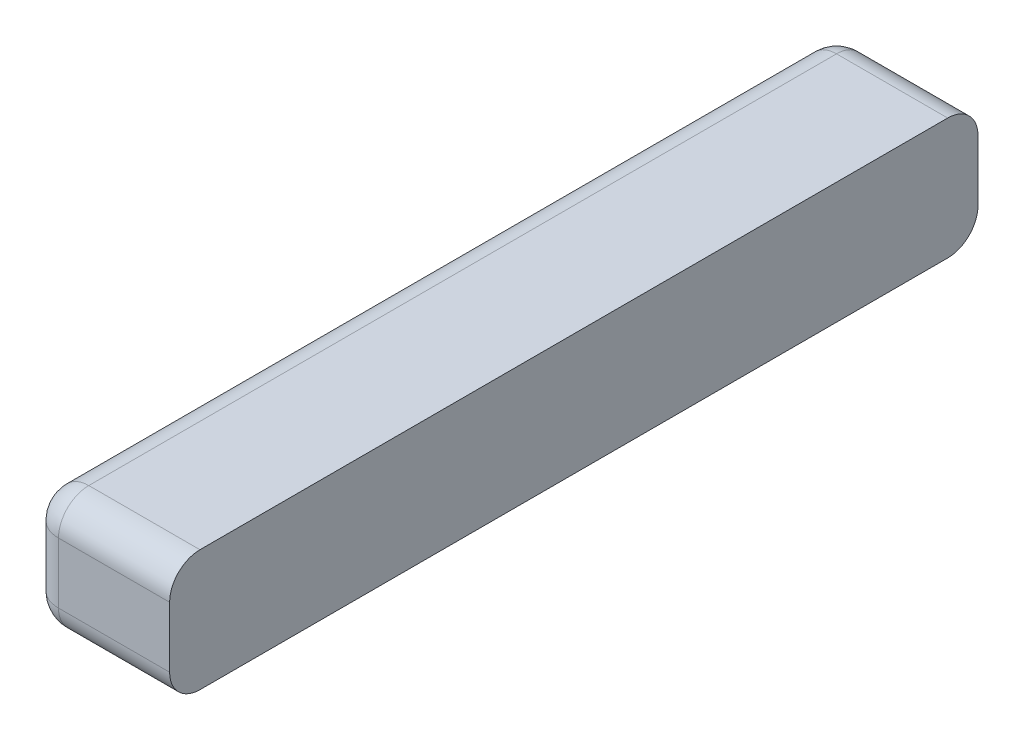
ISO-10303-21;
HEADER;
FILE_DESCRIPTION(('STEP AP214'),'2;1');
FILE_NAME('part.step','',(''),(''),'','','');
FILE_SCHEMA(('AUTOMOTIVE_DESIGN { 1 0 10303 214 1 1 1 1 }'));
ENDSEC;
DATA;
#1=APPLICATION_CONTEXT('core data for automotive mechanical design processes');
#2=APPLICATION_PROTOCOL_DEFINITION('international standard','automotive_design',2000,#1);
#3=PRODUCT_CONTEXT('',#1,'mechanical');
#4=PRODUCT('Part','Part','',(#3));
#5=PRODUCT_RELATED_PRODUCT_CATEGORY('part','',(#4));
#6=PRODUCT_DEFINITION_FORMATION('','',#4);
#7=PRODUCT_DEFINITION_CONTEXT('part definition',#1,'design');
#8=PRODUCT_DEFINITION('design','',#6,#7);
#9=PRODUCT_DEFINITION_SHAPE('','',#8);
#10=(LENGTH_UNIT() NAMED_UNIT(*) SI_UNIT(.MILLI.,.METRE.));
#11=(NAMED_UNIT(*) PLANE_ANGLE_UNIT() SI_UNIT($,.RADIAN.));
#12=(NAMED_UNIT(*) SI_UNIT($,.STERADIAN.) SOLID_ANGLE_UNIT());
#13=UNCERTAINTY_MEASURE_WITH_UNIT(LENGTH_MEASURE(1.E-05),#10,'distance_accuracy_value','');
#14=(GEOMETRIC_REPRESENTATION_CONTEXT(3) GLOBAL_UNCERTAINTY_ASSIGNED_CONTEXT((#13)) GLOBAL_UNIT_ASSIGNED_CONTEXT((#10,
#11,#12)) REPRESENTATION_CONTEXT('',''));
#15=CARTESIAN_POINT('',(0.,0.,0.));
#16=DIRECTION('',(0.,0.,1.));
#17=DIRECTION('',(1.,0.,0.));
#18=AXIS2_PLACEMENT_3D('',#15,#16,#17);
#19=CARTESIAN_POINT('',(-25.10519280825,0.,29.371744981599));
#20=DIRECTION('',(0.,-1.,0.));
#21=DIRECTION('',(0.,0.,-1.));
#22=AXIS2_PLACEMENT_3D('',#19,#20,#21);
#23=CYLINDRICAL_SURFACE('',#22,1.5);
#24=CARTESIAN_POINT('',(-25.10519280825,1.5,29.371744981599));
#25=DIRECTION('',(0.,1.,0.));
#26=DIRECTION('',(1.,0.,0.));
#27=AXIS2_PLACEMENT_3D('',#24,#25,#26);
#28=CIRCLE('',#27,1.5);
#29=CARTESIAN_POINT('',(-26.60519280825,1.5,29.371744981599));
#30=VERTEX_POINT('',#29);
#31=CARTESIAN_POINT('',(-25.10519280825,1.5,30.871744981599));
#32=VERTEX_POINT('',#31);
#33=EDGE_CURVE('E26',#30,#32,#28,.T.);
#34=ORIENTED_EDGE('',*,*,#33,.T.);
#35=DIRECTION('',(0.,-1.,0.));
#36=VECTOR('',#35,1.);
#37=CARTESIAN_POINT('',(-25.10519280825,0.,30.871744981599));
#38=LINE('',#37,#36);
#39=CARTESIAN_POINT('',(-25.10519280825,4.5,30.871744981599));
#40=VERTEX_POINT('',#39);
#41=EDGE_CURVE('E153',#40,#32,#38,.T.);
#42=ORIENTED_EDGE('',*,*,#41,.F.);
#43=CARTESIAN_POINT('',(-25.10519280825,4.5,29.371744981599));
#44=DIRECTION('',(0.,-1.,0.));
#45=DIRECTION('',(0.,0.,1.));
#46=AXIS2_PLACEMENT_3D('',#43,#44,#45);
#47=CIRCLE('',#46,1.5);
#48=CARTESIAN_POINT('',(-26.60519280825,4.5,29.371744981599));
#49=VERTEX_POINT('',#48);
#50=EDGE_CURVE('E11',#40,#49,#47,.T.);
#51=ORIENTED_EDGE('',*,*,#50,.T.);
#52=DIRECTION('',(0.,1.,0.));
#53=VECTOR('',#52,1.);
#54=CARTESIAN_POINT('',(-26.60519280825,6.,29.371744981599));
#55=LINE('',#54,#53);
#56=EDGE_CURVE('E148',#30,#49,#55,.T.);
#57=ORIENTED_EDGE('',*,*,#56,.F.);
#58=EDGE_LOOP('',(#34,#42,#51,#57));
#59=FACE_BOUND('',#58,.T.);
#60=ADVANCED_FACE('F16',(#59),#23,.T.);
#61=CARTESIAN_POINT('',(-25.10519280825,4.5,29.371744981599));
#62=DIRECTION('',(0.,1.,0.));
#63=DIRECTION('',(0.,0.,1.));
#64=AXIS2_PLACEMENT_3D('',#61,#62,#63);
#65=SPHERICAL_SURFACE('',#64,1.5);
#66=CARTESIAN_POINT('',(-25.10519280825,4.5,29.371744981599));
#67=DIRECTION('',(-1.,0.,0.));
#68=DIRECTION('',(0.,0.,1.));
#69=AXIS2_PLACEMENT_3D('',#66,#67,#68);
#70=CIRCLE('',#69,1.5);
#71=CARTESIAN_POINT('',(-25.10519280825,6.,29.371744981599));
#72=VERTEX_POINT('',#71);
#73=EDGE_CURVE('E177',#40,#72,#70,.T.);
#74=ORIENTED_EDGE('',*,*,#73,.T.);
#75=CARTESIAN_POINT('',(-25.10519280825,4.5,29.371744981599));
#76=DIRECTION('',(0.,0.,1.));
#77=DIRECTION('',(1.,0.,0.));
#78=AXIS2_PLACEMENT_3D('',#75,#76,#77);
#79=CIRCLE('',#78,1.5);
#80=EDGE_CURVE('E174',#72,#49,#79,.T.);
#81=ORIENTED_EDGE('',*,*,#80,.T.);
#82=ORIENTED_EDGE('',*,*,#50,.F.);
#83=EDGE_LOOP('',(#74,#81,#82));
#84=FACE_BOUND('',#83,.T.);
#85=ADVANCED_FACE('F314',(#84),#65,.T.);
#86=CARTESIAN_POINT('',(-25.10519280825,1.5,29.371744981599));
#87=DIRECTION('',(0.,-1.,0.));
#88=DIRECTION('',(0.,0.,-1.));
#89=AXIS2_PLACEMENT_3D('',#86,#87,#88);
#90=SPHERICAL_SURFACE('',#89,1.5);
#91=CARTESIAN_POINT('',(-25.10519280825,1.5,29.371744981599));
#92=DIRECTION('',(0.,0.,1.));
#93=DIRECTION('',(1.,0.,0.));
#94=AXIS2_PLACEMENT_3D('',#91,#92,#93);
#95=CIRCLE('',#94,1.5);
#96=CARTESIAN_POINT('',(-25.10519280825,0.,29.371744981599));
#97=VERTEX_POINT('',#96);
#98=EDGE_CURVE('E170',#30,#97,#95,.T.);
#99=ORIENTED_EDGE('',*,*,#98,.T.);
#100=CARTESIAN_POINT('',(-25.10519280825,1.5,29.371744981599));
#101=DIRECTION('',(-1.,0.,0.));
#102=DIRECTION('',(0.,0.,1.));
#103=AXIS2_PLACEMENT_3D('',#100,#101,#102);
#104=CIRCLE('',#103,1.5);
#105=EDGE_CURVE('E19',#97,#32,#104,.T.);
#106=ORIENTED_EDGE('',*,*,#105,.T.);
#107=ORIENTED_EDGE('',*,*,#33,.F.);
#108=EDGE_LOOP('',(#99,#106,#107));
#109=FACE_BOUND('',#108,.T.);
#110=ADVANCED_FACE('F232',(#109),#90,.T.);
#111=CARTESIAN_POINT('',(-26.60519280825,4.5,29.371744981599));
#112=DIRECTION('',(1.,0.,0.));
#113=DIRECTION('',(0.,0.,-1.));
#114=AXIS2_PLACEMENT_3D('',#111,#112,#113);
#115=CYLINDRICAL_SURFACE('',#114,1.5);
#116=CARTESIAN_POINT('',(-19.60519280825,4.5,29.371744981599));
#117=DIRECTION('',(1.,0.,0.));
#118=DIRECTION('',(0.,0.,1.));
#119=AXIS2_PLACEMENT_3D('',#116,#117,#118);
#120=CIRCLE('',#119,1.5);
#121=CARTESIAN_POINT('',(-19.60519280825,6.,29.371744981599));
#122=VERTEX_POINT('',#121);
#123=CARTESIAN_POINT('',(-19.60519280825,4.5,30.871744981599));
#124=VERTEX_POINT('',#123);
#125=EDGE_CURVE('E187',#122,#124,#120,.T.);
#126=ORIENTED_EDGE('',*,*,#125,.F.);
#127=DIRECTION('',(1.,0.,0.));
#128=VECTOR('',#127,1.);
#129=CARTESIAN_POINT('',(-26.60519280825,6.,29.371744981599));
#130=LINE('',#129,#128);
#131=EDGE_CURVE('E159',#72,#122,#130,.T.);
#132=ORIENTED_EDGE('',*,*,#131,.F.);
#133=ORIENTED_EDGE('',*,*,#73,.F.);
#134=DIRECTION('',(-1.,0.,0.));
#135=VECTOR('',#134,1.);
#136=CARTESIAN_POINT('',(-26.60519280825,4.5,30.871744981599));
#137=LINE('',#136,#135);
#138=EDGE_CURVE('E150',#124,#40,#137,.T.);
#139=ORIENTED_EDGE('',*,*,#138,.F.);
#140=EDGE_LOOP('',(#126,#132,#133,#139));
#141=FACE_BOUND('',#140,.T.);
#142=ADVANCED_FACE('F225',(#141),#115,.T.);
#143=CARTESIAN_POINT('',(-25.10519280825,4.5,0.));
#144=DIRECTION('',(0.,0.,1.));
#145=DIRECTION('',(1.,0.,0.));
#146=AXIS2_PLACEMENT_3D('',#143,#144,#145);
#147=CYLINDRICAL_SURFACE('',#146,1.5);
#148=CARTESIAN_POINT('',(-25.10519280825,4.5,-7.628255018401));
#149=DIRECTION('',(0.,0.,1.));
#150=DIRECTION('',(-1.,0.,0.));
#151=AXIS2_PLACEMENT_3D('',#148,#149,#150);
#152=CIRCLE('',#151,1.5);
#153=CARTESIAN_POINT('',(-25.10519280825,6.,-7.628255018401));
#154=VERTEX_POINT('',#153);
#155=CARTESIAN_POINT('',(-26.60519280825,4.5,-7.628255018401));
#156=VERTEX_POINT('',#155);
#157=EDGE_CURVE('E40',#154,#156,#152,.T.);
#158=ORIENTED_EDGE('',*,*,#157,.T.);
#159=DIRECTION('',(0.,0.,-1.));
#160=VECTOR('',#159,1.);
#161=CARTESIAN_POINT('',(-26.60519280825,4.5,-9.128255018401));
#162=LINE('',#161,#160);
#163=EDGE_CURVE('E188',#49,#156,#162,.T.);
#164=ORIENTED_EDGE('',*,*,#163,.F.);
#165=ORIENTED_EDGE('',*,*,#80,.F.);
#166=DIRECTION('',(0.,0.,1.));
#167=VECTOR('',#166,1.);
#168=CARTESIAN_POINT('',(-25.10519280825,6.,30.871744981599));
#169=LINE('',#168,#167);
#170=EDGE_CURVE('E164',#154,#72,#169,.T.);
#171=ORIENTED_EDGE('',*,*,#170,.F.);
#172=EDGE_LOOP('',(#158,#164,#165,#171));
#173=FACE_BOUND('',#172,.T.);
#174=ADVANCED_FACE('F231',(#173),#147,.T.);
#175=CARTESIAN_POINT('',(-25.10519280825,1.5,0.));
#176=DIRECTION('',(0.,0.,-1.));
#177=DIRECTION('',(-1.,0.,0.));
#178=AXIS2_PLACEMENT_3D('',#175,#176,#177);
#179=CYLINDRICAL_SURFACE('',#178,1.5);
#180=CARTESIAN_POINT('',(-25.10519280825,1.5,-7.628255018401));
#181=DIRECTION('',(0.,0.,1.));
#182=DIRECTION('',(-1.,0.,0.));
#183=AXIS2_PLACEMENT_3D('',#180,#181,#182);
#184=CIRCLE('',#183,1.5);
#185=CARTESIAN_POINT('',(-26.60519280825,1.5,-7.628255018401));
#186=VERTEX_POINT('',#185);
#187=CARTESIAN_POINT('',(-25.10519280825,0.,-7.628255018401));
#188=VERTEX_POINT('',#187);
#189=EDGE_CURVE('E168',#186,#188,#184,.T.);
#190=ORIENTED_EDGE('',*,*,#189,.T.);
#191=DIRECTION('',(0.,0.,-1.));
#192=VECTOR('',#191,1.);
#193=CARTESIAN_POINT('',(-25.10519280825,0.,-9.128255018401));
#194=LINE('',#193,#192);
#195=EDGE_CURVE('E183',#97,#188,#194,.T.);
#196=ORIENTED_EDGE('',*,*,#195,.F.);
#197=ORIENTED_EDGE('',*,*,#98,.F.);
#198=DIRECTION('',(0.,0.,1.));
#199=VECTOR('',#198,1.);
#200=CARTESIAN_POINT('',(-26.60519280825,1.5,30.871744981599));
#201=LINE('',#200,#199);
#202=EDGE_CURVE('E207',#186,#30,#201,.T.);
#203=ORIENTED_EDGE('',*,*,#202,.F.);
#204=EDGE_LOOP('',(#190,#196,#197,#203));
#205=FACE_BOUND('',#204,.T.);
#206=ADVANCED_FACE('F257',(#205),#179,.T.);
#207=CARTESIAN_POINT('',(-26.60519280825,1.5,29.371744981599));
#208=DIRECTION('',(1.,0.,0.));
#209=DIRECTION('',(0.,0.,-1.));
#210=AXIS2_PLACEMENT_3D('',#207,#208,#209);
#211=CYLINDRICAL_SURFACE('',#210,1.5);
#212=CARTESIAN_POINT('',(-19.60519280825,1.5,29.371744981599));
#213=DIRECTION('',(1.,0.,0.));
#214=DIRECTION('',(0.,0.,1.));
#215=AXIS2_PLACEMENT_3D('',#212,#213,#214);
#216=CIRCLE('',#215,1.5);
#217=CARTESIAN_POINT('',(-19.60519280825,1.5,30.871744981599));
#218=VERTEX_POINT('',#217);
#219=CARTESIAN_POINT('',(-19.60519280825,0.,29.371744981599));
#220=VERTEX_POINT('',#219);
#221=EDGE_CURVE('E184',#218,#220,#216,.T.);
#222=ORIENTED_EDGE('',*,*,#221,.F.);
#223=DIRECTION('',(1.,0.,0.));
#224=VECTOR('',#223,1.);
#225=CARTESIAN_POINT('',(-26.60519280825,1.5,30.871744981599));
#226=LINE('',#225,#224);
#227=EDGE_CURVE('E158',#32,#218,#226,.T.);
#228=ORIENTED_EDGE('',*,*,#227,.F.);
#229=ORIENTED_EDGE('',*,*,#105,.F.);
#230=DIRECTION('',(-1.,0.,0.));
#231=VECTOR('',#230,1.);
#232=CARTESIAN_POINT('',(-26.60519280825,0.,29.371744981599));
#233=LINE('',#232,#231);
#234=EDGE_CURVE('E179',#220,#97,#233,.T.);
#235=ORIENTED_EDGE('',*,*,#234,.F.);
#236=EDGE_LOOP('',(#222,#228,#229,#235));
#237=FACE_BOUND('',#236,.T.);
#238=ADVANCED_FACE('F252',(#237),#211,.T.);
#239=CARTESIAN_POINT('',(-25.10519280825,4.5,-7.628255018401));
#240=DIRECTION('',(0.,0.,-1.));
#241=DIRECTION('',(-1.,0.,0.));
#242=AXIS2_PLACEMENT_3D('',#239,#240,#241);
#243=SPHERICAL_SURFACE('',#242,1.5);
#244=CARTESIAN_POINT('',(-25.10519280825,4.5,-7.628255018401));
#245=DIRECTION('',(-1.,0.,0.));
#246=DIRECTION('',(0.,0.,1.));
#247=AXIS2_PLACEMENT_3D('',#244,#245,#246);
#248=CIRCLE('',#247,1.5);
#249=CARTESIAN_POINT('',(-25.10519280825,4.5,-9.128255018401));
#250=VERTEX_POINT('',#249);
#251=EDGE_CURVE('E165',#154,#250,#248,.T.);
#252=ORIENTED_EDGE('',*,*,#251,.T.);
#253=CARTESIAN_POINT('',(-25.10519280825,4.5,-7.628255018401));
#254=DIRECTION('',(0.,1.,0.));
#255=DIRECTION('',(0.,0.,1.));
#256=AXIS2_PLACEMENT_3D('',#253,#254,#255);
#257=CIRCLE('',#256,1.5);
#258=EDGE_CURVE('E199',#250,#156,#257,.T.);
#259=ORIENTED_EDGE('',*,*,#258,.T.);
#260=ORIENTED_EDGE('',*,*,#157,.F.);
#261=EDGE_LOOP('',(#252,#259,#260));
#262=FACE_BOUND('',#261,.T.);
#263=ADVANCED_FACE('F256',(#262),#243,.T.);
#264=CARTESIAN_POINT('',(-25.10519280825,1.5,-7.628255018401));
#265=DIRECTION('',(0.,0.,-1.));
#266=DIRECTION('',(-1.,0.,0.));
#267=AXIS2_PLACEMENT_3D('',#264,#265,#266);
#268=SPHERICAL_SURFACE('',#267,1.5);
#269=CARTESIAN_POINT('',(-25.10519280825,1.5,-7.628255018401));
#270=DIRECTION('',(0.,-1.,0.));
#271=DIRECTION('',(0.,0.,-1.));
#272=AXIS2_PLACEMENT_3D('',#269,#270,#271);
#273=CIRCLE('',#272,1.5);
#274=CARTESIAN_POINT('',(-25.10519280825,1.5,-9.128255018401));
#275=VERTEX_POINT('',#274);
#276=EDGE_CURVE('E169',#186,#275,#273,.T.);
#277=ORIENTED_EDGE('',*,*,#276,.T.);
#278=CARTESIAN_POINT('',(-25.10519280825,1.5,-7.628255018401));
#279=DIRECTION('',(-1.,0.,0.));
#280=DIRECTION('',(0.,0.,1.));
#281=AXIS2_PLACEMENT_3D('',#278,#279,#280);
#282=CIRCLE('',#281,1.5);
#283=EDGE_CURVE('E121',#275,#188,#282,.T.);
#284=ORIENTED_EDGE('',*,*,#283,.T.);
#285=ORIENTED_EDGE('',*,*,#189,.F.);
#286=EDGE_LOOP('',(#277,#284,#285));
#287=FACE_BOUND('',#286,.T.);
#288=ADVANCED_FACE('F265',(#287),#268,.T.);
#289=CARTESIAN_POINT('',(-26.60519280825,4.5,-7.628255018401));
#290=DIRECTION('',(1.,0.,0.));
#291=DIRECTION('',(0.,0.,-1.));
#292=AXIS2_PLACEMENT_3D('',#289,#290,#291);
#293=CYLINDRICAL_SURFACE('',#292,1.5);
#294=CARTESIAN_POINT('',(-19.60519280825,4.5,-7.628255018401));
#295=DIRECTION('',(1.,0.,0.));
#296=DIRECTION('',(0.,0.,1.));
#297=AXIS2_PLACEMENT_3D('',#294,#295,#296);
#298=CIRCLE('',#297,1.5);
#299=CARTESIAN_POINT('',(-19.60519280825,4.5,-9.128255018401));
#300=VERTEX_POINT('',#299);
#301=CARTESIAN_POINT('',(-19.60519280825,6.,-7.628255018401));
#302=VERTEX_POINT('',#301);
#303=EDGE_CURVE('E108',#300,#302,#298,.T.);
#304=ORIENTED_EDGE('',*,*,#303,.F.);
#305=DIRECTION('',(1.,0.,0.));
#306=VECTOR('',#305,1.);
#307=CARTESIAN_POINT('',(-26.60519280825,4.5,-9.128255018401));
#308=LINE('',#307,#306);
#309=EDGE_CURVE('E112',#250,#300,#308,.T.);
#310=ORIENTED_EDGE('',*,*,#309,.F.);
#311=ORIENTED_EDGE('',*,*,#251,.F.);
#312=DIRECTION('',(-1.,0.,0.));
#313=VECTOR('',#312,1.);
#314=CARTESIAN_POINT('',(-26.60519280825,6.,-7.628255018401));
#315=LINE('',#314,#313);
#316=EDGE_CURVE('E115',#302,#154,#315,.T.);
#317=ORIENTED_EDGE('',*,*,#316,.F.);
#318=EDGE_LOOP('',(#304,#310,#311,#317));
#319=FACE_BOUND('',#318,.T.);
#320=ADVANCED_FACE('F110',(#319),#293,.T.);
#321=CARTESIAN_POINT('',(-25.10519280825,0.,-7.628255018401));
#322=DIRECTION('',(0.,1.,0.));
#323=DIRECTION('',(0.,0.,1.));
#324=AXIS2_PLACEMENT_3D('',#321,#322,#323);
#325=CYLINDRICAL_SURFACE('',#324,1.5);
#326=ORIENTED_EDGE('',*,*,#258,.F.);
#327=DIRECTION('',(0.,1.,0.));
#328=VECTOR('',#327,1.);
#329=CARTESIAN_POINT('',(-25.10519280825,6.,-9.128255018401));
#330=LINE('',#329,#328);
#331=EDGE_CURVE('E130',#275,#250,#330,.T.);
#332=ORIENTED_EDGE('',*,*,#331,.F.);
#333=ORIENTED_EDGE('',*,*,#276,.F.);
#334=DIRECTION('',(0.,-1.,0.));
#335=VECTOR('',#334,1.);
#336=CARTESIAN_POINT('',(-26.60519280825,0.,-7.628255018401));
#337=LINE('',#336,#335);
#338=EDGE_CURVE('E192',#156,#186,#337,.T.);
#339=ORIENTED_EDGE('',*,*,#338,.F.);
#340=EDGE_LOOP('',(#326,#332,#333,#339));
#341=FACE_BOUND('',#340,.T.);
#342=ADVANCED_FACE('F292',(#341),#325,.T.);
#343=CARTESIAN_POINT('',(-26.60519280825,1.5,-7.628255018401));
#344=DIRECTION('',(1.,0.,0.));
#345=DIRECTION('',(0.,0.,-1.));
#346=AXIS2_PLACEMENT_3D('',#343,#344,#345);
#347=CYLINDRICAL_SURFACE('',#346,1.5);
#348=CARTESIAN_POINT('',(-19.60519280825,1.5,-7.628255018401));
#349=DIRECTION('',(1.,0.,0.));
#350=DIRECTION('',(0.,0.,1.));
#351=AXIS2_PLACEMENT_3D('',#348,#349,#350);
#352=CIRCLE('',#351,1.5);
#353=CARTESIAN_POINT('',(-19.60519280825,0.,-7.628255018401));
#354=VERTEX_POINT('',#353);
#355=CARTESIAN_POINT('',(-19.60519280825,1.5,-9.128255018401));
#356=VERTEX_POINT('',#355);
#357=EDGE_CURVE('E122',#354,#356,#352,.T.);
#358=ORIENTED_EDGE('',*,*,#357,.F.);
#359=DIRECTION('',(1.,0.,0.));
#360=VECTOR('',#359,1.);
#361=CARTESIAN_POINT('',(-26.60519280825,0.,-7.628255018401));
#362=LINE('',#361,#360);
#363=EDGE_CURVE('E196',#188,#354,#362,.T.);
#364=ORIENTED_EDGE('',*,*,#363,.F.);
#365=ORIENTED_EDGE('',*,*,#283,.F.);
#366=DIRECTION('',(-1.,0.,0.));
#367=VECTOR('',#366,1.);
#368=CARTESIAN_POINT('',(-26.60519280825,1.5,-9.128255018401));
#369=LINE('',#368,#367);
#370=EDGE_CURVE('E139',#356,#275,#369,.T.);
#371=ORIENTED_EDGE('',*,*,#370,.F.);
#372=EDGE_LOOP('',(#358,#364,#365,#371));
#373=FACE_BOUND('',#372,.T.);
#374=ADVANCED_FACE('F288',(#373),#347,.T.);
#375=CARTESIAN_POINT('',(-19.60519280825,0.,0.));
#376=DIRECTION('',(-1.,0.,0.));
#377=DIRECTION('',(0.,0.,1.));
#378=AXIS2_PLACEMENT_3D('',#375,#376,#377);
#379=PLANE('',#378);
#380=DIRECTION('',(0.,0.,-1.));
#381=VECTOR('',#380,1.);
#382=CARTESIAN_POINT('',(-19.60519280825,6.,-9.128255018401));
#383=LINE('',#382,#381);
#384=EDGE_CURVE('E163',#122,#302,#383,.T.);
#385=ORIENTED_EDGE('',*,*,#384,.F.);
#386=ORIENTED_EDGE('',*,*,#125,.T.);
#387=DIRECTION('',(0.,1.,0.));
#388=VECTOR('',#387,1.);
#389=CARTESIAN_POINT('',(-19.60519280825,6.,30.871744981599));
#390=LINE('',#389,#388);
#391=EDGE_CURVE('E154',#218,#124,#390,.T.);
#392=ORIENTED_EDGE('',*,*,#391,.F.);
#393=ORIENTED_EDGE('',*,*,#221,.T.);
#394=DIRECTION('',(0.,0.,1.));
#395=VECTOR('',#394,1.);
#396=CARTESIAN_POINT('',(-19.60519280825,0.,-9.128255018401));
#397=LINE('',#396,#395);
#398=EDGE_CURVE('E132',#354,#220,#397,.T.);
#399=ORIENTED_EDGE('',*,*,#398,.F.);
#400=ORIENTED_EDGE('',*,*,#357,.T.);
#401=DIRECTION('',(0.,-1.,0.));
#402=VECTOR('',#401,1.);
#403=CARTESIAN_POINT('',(-19.60519280825,6.,-9.128255018401));
#404=LINE('',#403,#402);
#405=EDGE_CURVE('E128',#300,#356,#404,.T.);
#406=ORIENTED_EDGE('',*,*,#405,.F.);
#407=ORIENTED_EDGE('',*,*,#303,.T.);
#408=EDGE_LOOP('',(#385,#386,#392,#393,#399,#400,#406,#407));
#409=FACE_BOUND('',#408,.T.);
#410=ADVANCED_FACE('F134',(#409),#379,.F.);
#411=CARTESIAN_POINT('',(-26.60519280825,0.,0.));
#412=DIRECTION('',(-1.,0.,0.));
#413=DIRECTION('',(0.,0.,1.));
#414=AXIS2_PLACEMENT_3D('',#411,#412,#413);
#415=PLANE('',#414);
#416=ORIENTED_EDGE('',*,*,#202,.T.);
#417=ORIENTED_EDGE('',*,*,#56,.T.);
#418=ORIENTED_EDGE('',*,*,#163,.T.);
#419=ORIENTED_EDGE('',*,*,#338,.T.);
#420=EDGE_LOOP('',(#416,#417,#418,#419));
#421=FACE_BOUND('',#420,.T.);
#422=ADVANCED_FACE('F300',(#421),#415,.T.);
#423=CARTESIAN_POINT('',(-26.60519280825,6.,-9.128255018401));
#424=DIRECTION('',(0.,-1.,0.));
#425=DIRECTION('',(0.,0.,-1.));
#426=AXIS2_PLACEMENT_3D('',#423,#424,#425);
#427=PLANE('',#426);
#428=ORIENTED_EDGE('',*,*,#170,.T.);
#429=ORIENTED_EDGE('',*,*,#131,.T.);
#430=ORIENTED_EDGE('',*,*,#384,.T.);
#431=ORIENTED_EDGE('',*,*,#316,.T.);
#432=EDGE_LOOP('',(#428,#429,#430,#431));
#433=FACE_BOUND('',#432,.T.);
#434=ADVANCED_FACE('F280',(#433),#427,.F.);
#435=CARTESIAN_POINT('',(-26.60519280825,6.,30.871744981599));
#436=DIRECTION('',(0.,0.,-1.));
#437=DIRECTION('',(0.,-1.,0.));
#438=AXIS2_PLACEMENT_3D('',#435,#436,#437);
#439=PLANE('',#438);
#440=ORIENTED_EDGE('',*,*,#391,.T.);
#441=ORIENTED_EDGE('',*,*,#138,.T.);
#442=ORIENTED_EDGE('',*,*,#41,.T.);
#443=ORIENTED_EDGE('',*,*,#227,.T.);
#444=EDGE_LOOP('',(#440,#441,#442,#443));
#445=FACE_BOUND('',#444,.T.);
#446=ADVANCED_FACE('F276',(#445),#439,.F.);
#447=CARTESIAN_POINT('',(-26.60519280825,0.,-9.128255018401));
#448=DIRECTION('',(0.,1.,0.));
#449=DIRECTION('',(1.,0.,0.));
#450=AXIS2_PLACEMENT_3D('',#447,#448,#449);
#451=PLANE('',#450);
#452=ORIENTED_EDGE('',*,*,#398,.T.);
#453=ORIENTED_EDGE('',*,*,#234,.T.);
#454=ORIENTED_EDGE('',*,*,#195,.T.);
#455=ORIENTED_EDGE('',*,*,#363,.T.);
#456=EDGE_LOOP('',(#452,#453,#454,#455));
#457=FACE_BOUND('',#456,.T.);
#458=ADVANCED_FACE('F245',(#457),#451,.F.);
#459=CARTESIAN_POINT('',(-26.60519280825,6.,-9.128255018401));
#460=DIRECTION('',(0.,0.,1.));
#461=DIRECTION('',(1.,0.,0.));
#462=AXIS2_PLACEMENT_3D('',#459,#460,#461);
#463=PLANE('',#462);
#464=ORIENTED_EDGE('',*,*,#405,.T.);
#465=ORIENTED_EDGE('',*,*,#370,.T.);
#466=ORIENTED_EDGE('',*,*,#331,.T.);
#467=ORIENTED_EDGE('',*,*,#309,.T.);
#468=EDGE_LOOP('',(#464,#465,#466,#467));
#469=FACE_BOUND('',#468,.T.);
#470=ADVANCED_FACE('F126',(#469),#463,.F.);
#471=CLOSED_SHELL('',(#60,#85,#110,#142,#174,#206,#238,#263,#288,#320,#342,#374,#410,#422,#434,
#446,#458,#470));
#472=MANIFOLD_SOLID_BREP('B1',#471);
#473=ADVANCED_BREP_SHAPE_REPRESENTATION('',(#18,#472),#14);
#474=SHAPE_DEFINITION_REPRESENTATION(#9,#473);
ENDSEC;
END-ISO-10303-21;
